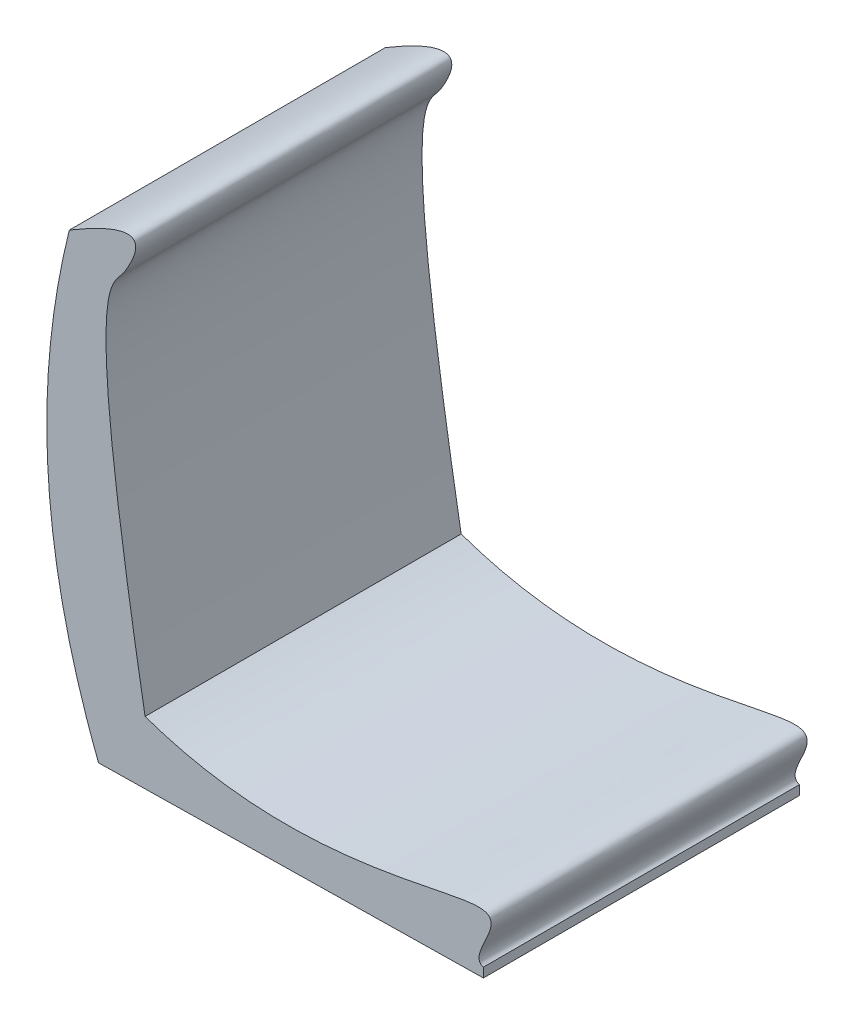
ISO-10303-21;
HEADER;
FILE_DESCRIPTION(('STEP AP214'),'2;1');
FILE_NAME('part.step','',(''),(''),'','','');
FILE_SCHEMA(('AUTOMOTIVE_DESIGN { 1 0 10303 214 1 1 1 1 }'));
ENDSEC;
DATA;
#1=APPLICATION_CONTEXT('core data for automotive mechanical design processes');
#2=APPLICATION_PROTOCOL_DEFINITION('international standard','automotive_design',2000,#1);
#3=PRODUCT_CONTEXT('',#1,'mechanical');
#4=PRODUCT('Part','Part','',(#3));
#5=PRODUCT_RELATED_PRODUCT_CATEGORY('part','',(#4));
#6=PRODUCT_DEFINITION_FORMATION('','',#4);
#7=PRODUCT_DEFINITION_CONTEXT('part definition',#1,'design');
#8=PRODUCT_DEFINITION('design','',#6,#7);
#9=PRODUCT_DEFINITION_SHAPE('','',#8);
#10=(LENGTH_UNIT() NAMED_UNIT(*) SI_UNIT(.MILLI.,.METRE.));
#11=(NAMED_UNIT(*) PLANE_ANGLE_UNIT() SI_UNIT($,.RADIAN.));
#12=(NAMED_UNIT(*) SI_UNIT($,.STERADIAN.) SOLID_ANGLE_UNIT());
#13=UNCERTAINTY_MEASURE_WITH_UNIT(LENGTH_MEASURE(1.E-05),#10,'distance_accuracy_value','');
#14=(GEOMETRIC_REPRESENTATION_CONTEXT(3) GLOBAL_UNCERTAINTY_ASSIGNED_CONTEXT((#13)) GLOBAL_UNIT_ASSIGNED_CONTEXT((#10,
#11,#12)) REPRESENTATION_CONTEXT('',''));
#15=CARTESIAN_POINT('',(0.,0.,0.));
#16=DIRECTION('',(0.,0.,1.));
#17=DIRECTION('',(1.,0.,0.));
#18=AXIS2_PLACEMENT_3D('',#15,#16,#17);
#19=CARTESIAN_POINT('',(363.769485966271,11.3362005591572,170.));
#20=DIRECTION('',(-0.999874354439681,-0.0158516665947739,0.));
#21=DIRECTION('',(0.0158516665947739,-0.999874354439681,0.));
#22=AXIS2_PLACEMENT_3D('',#19,#20,#21);
#23=PLANE('',#22);
#24=DIRECTION('',(-0.0158516665947739,0.999874354439681,0.));
#25=VECTOR('',#24,1.);
#26=CARTESIAN_POINT('',(363.769485966271,11.3362005591572,-170.));
#27=LINE('',#26,#25);
#28=CARTESIAN_POINT('',(363.928002632218,1.33745701476038,-170.));
#29=VERTEX_POINT('',#28);
#30=CARTESIAN_POINT('',(363.769485966271,11.3362005591572,-170.));
#31=VERTEX_POINT('',#30);
#32=EDGE_CURVE('E84',#29,#31,#27,.T.);
#33=ORIENTED_EDGE('',*,*,#32,.T.);
#34=DIRECTION('',(0.,0.,-1.));
#35=VECTOR('',#34,1.);
#36=CARTESIAN_POINT('',(363.769485966271,11.3362005591572,170.));
#37=LINE('',#36,#35);
#38=CARTESIAN_POINT('',(363.769485966271,11.3362005591572,170.));
#39=VERTEX_POINT('',#38);
#40=EDGE_CURVE('E11',#39,#31,#37,.T.);
#41=ORIENTED_EDGE('',*,*,#40,.F.);
#42=DIRECTION('',(-0.0158516665947739,0.999874354439681,0.));
#43=VECTOR('',#42,1.);
#44=CARTESIAN_POINT('',(363.769485966271,11.3362005591572,170.));
#45=LINE('',#44,#43);
#46=CARTESIAN_POINT('',(363.928002632218,1.33745701476038,170.));
#47=VERTEX_POINT('',#46);
#48=EDGE_CURVE('E78',#47,#39,#45,.T.);
#49=ORIENTED_EDGE('',*,*,#48,.F.);
#50=DIRECTION('',(0.,0.,-1.));
#51=VECTOR('',#50,1.);
#52=CARTESIAN_POINT('',(363.928002632218,1.33745701476038,170.));
#53=LINE('',#52,#51);
#54=EDGE_CURVE('E73',#47,#29,#53,.T.);
#55=ORIENTED_EDGE('',*,*,#54,.T.);
#56=EDGE_LOOP('',(#33,#41,#49,#55));
#57=FACE_BOUND('',#56,.T.);
#58=ADVANCED_FACE('F35',(#57),#23,.F.);
#59=CARTESIAN_POINT('',(-81.5168545077962,475.367364151518,170.));
#60=CARTESIAN_POINT('',(-82.7811158844958,470.304932433275,170.));
#61=CARTESIAN_POINT('',(-85.2215477803148,460.138150210215,170.));
#62=CARTESIAN_POINT('',(-89.6924466930047,439.866979620613,170.));
#63=CARTESIAN_POINT('',(-94.5384799487372,414.539481529264,170.));
#64=CARTESIAN_POINT('',(-99.1562538715719,384.199279399648,170.));
#65=CARTESIAN_POINT('',(-103.718426393131,343.806201553961,170.));
#66=CARTESIAN_POINT('',(-106.427442665198,293.43767581807,170.));
#67=CARTESIAN_POINT('',(-104.885012492461,233.20457503457,170.));
#68=CARTESIAN_POINT('',(-98.5488265595769,173.195950205866,170.));
#69=CARTESIAN_POINT('',(-89.2772276187725,123.388994875682,170.));
#70=CARTESIAN_POINT('',(-79.4671087369465,83.6676949331466,170.));
#71=CARTESIAN_POINT('',(-70.9172804866581,53.9459625175101,170.));
#72=CARTESIAN_POINT('',(-62.7892339814446,29.2168512033704,170.));
#73=CARTESIAN_POINT('',(-56.5943313014686,11.9661448879851,170.));
#74=CARTESIAN_POINT('',(-52.8796778820532,2.06917785632979,170.));
#75=CARTESIAN_POINT('',(-51.0209981225807,-2.78678938512905,170.));
#76=CARTESIAN_POINT('',(-50.0916478449538,-5.22626915134108,170.));
#77=B_SPLINE_CURVE_WITH_KNOTS('',3,(#59,#60,#61,#62,#63,#64,#65,#66,#67,#68,#69,#70,#71,#72,#73,
#74,#75,#76),.UNSPECIFIED.,.F.,.F.,(4,1,1,1,1,1,1,1,1,1,1,1,1,1,1,4),(0.,0.0316937263883437,
0.0633874527766874,0.126774905553375,0.190162358330062,0.253549811106749,0.380324716660124,
0.507099622213499,0.633874527766874,0.760649433320248,0.824036886096936,0.887424338873623,
0.95081179165031,0.982505518038654,0.998352381232826,1.014199244427),.UNSPECIFIED.);
#78=DIRECTION('',(0.,0.,-1.));
#79=VECTOR('',#78,1.);
#80=SURFACE_OF_LINEAR_EXTRUSION('',#77,#79);
#81=CARTESIAN_POINT('',(-81.5168545077962,475.367364151518,-170.));
#82=CARTESIAN_POINT('',(-82.7811158844958,470.304932433275,-170.));
#83=CARTESIAN_POINT('',(-85.2215477803148,460.138150210215,-170.));
#84=CARTESIAN_POINT('',(-89.6924466930047,439.866979620613,-170.));
#85=CARTESIAN_POINT('',(-94.5384799487372,414.539481529264,-170.));
#86=CARTESIAN_POINT('',(-99.1562538715719,384.199279399648,-170.));
#87=CARTESIAN_POINT('',(-103.718426393131,343.806201553961,-170.));
#88=CARTESIAN_POINT('',(-106.427442665198,293.43767581807,-170.));
#89=CARTESIAN_POINT('',(-104.885012492461,233.20457503457,-170.));
#90=CARTESIAN_POINT('',(-98.5488265595769,173.195950205866,-170.));
#91=CARTESIAN_POINT('',(-89.2772276187725,123.388994875682,-170.));
#92=CARTESIAN_POINT('',(-79.4671087369465,83.6676949331466,-170.));
#93=CARTESIAN_POINT('',(-70.9172804866581,53.9459625175101,-170.));
#94=CARTESIAN_POINT('',(-62.7892339814446,29.2168512033704,-170.));
#95=CARTESIAN_POINT('',(-56.5943313014686,11.9661448879851,-170.));
#96=CARTESIAN_POINT('',(-52.8796778820532,2.06917785632979,-170.));
#97=CARTESIAN_POINT('',(-51.0209981225807,-2.78678938512905,-170.));
#98=CARTESIAN_POINT('',(-50.0916478449538,-5.22626915134108,-170.));
#99=B_SPLINE_CURVE_WITH_KNOTS('',3,(#81,#82,#83,#84,#85,#86,#87,#88,#89,#90,#91,#92,#93,#94,#95,
#96,#97,#98),.UNSPECIFIED.,.F.,.F.,(4,1,1,1,1,1,1,1,1,1,1,1,1,1,1,4),(0.,0.0316937263883437,
0.0633874527766874,0.126774905553375,0.190162358330062,0.253549811106749,0.380324716660124,
0.507099622213499,0.633874527766874,0.760649433320248,0.824036886096936,0.887424338873623,
0.95081179165031,0.982505518038654,0.998352381232826,1.014199244427),.UNSPECIFIED.);
#100=CARTESIAN_POINT('',(-81.5168545077962,475.367364151518,-170.));
#101=VERTEX_POINT('',#100);
#102=CARTESIAN_POINT('',(-50.0916478449538,-5.22626915134108,-170.));
#103=VERTEX_POINT('',#102);
#104=EDGE_CURVE('E65',#101,#103,#99,.T.);
#105=ORIENTED_EDGE('',*,*,#104,.T.);
#106=DIRECTION('',(0.,0.,-1.));
#107=VECTOR('',#106,1.);
#108=CARTESIAN_POINT('',(-50.0916478449538,-5.22626915134108,170.));
#109=LINE('',#108,#107);
#110=CARTESIAN_POINT('',(-50.0916478449538,-5.22626915134108,170.));
#111=VERTEX_POINT('',#110);
#112=EDGE_CURVE('E75',#111,#103,#109,.T.);
#113=ORIENTED_EDGE('',*,*,#112,.F.);
#114=CARTESIAN_POINT('',(-81.5168545077962,475.367364151518,170.));
#115=VERTEX_POINT('',#114);
#116=EDGE_CURVE('E108',#115,#111,#77,.T.);
#117=ORIENTED_EDGE('',*,*,#116,.F.);
#118=DIRECTION('',(0.,0.,-1.));
#119=VECTOR('',#118,1.);
#120=CARTESIAN_POINT('',(-81.5168545077962,475.367364151518,170.));
#121=LINE('',#120,#119);
#122=EDGE_CURVE('E43',#115,#101,#121,.T.);
#123=ORIENTED_EDGE('',*,*,#122,.T.);
#124=EDGE_LOOP('',(#105,#113,#117,#123));
#125=FACE_BOUND('',#124,.T.);
#126=ADVANCED_FACE('F107',(#125),#80,.F.);
#127=CARTESIAN_POINT('',(-50.0916478449538,-5.22626915134108,170.));
#128=DIRECTION('',(-0.0158516665947753,0.999874354439681,0.));
#129=DIRECTION('',(-0.999874354439681,-0.0158516665947753,0.));
#130=AXIS2_PLACEMENT_3D('',#127,#128,#129);
#131=PLANE('',#130);
#132=DIRECTION('',(0.999874354439681,0.0158516665947753,0.));
#133=VECTOR('',#132,1.);
#134=CARTESIAN_POINT('',(-50.0916478449538,-5.22626915134108,-170.));
#135=LINE('',#134,#133);
#136=EDGE_CURVE('E70',#103,#29,#135,.T.);
#137=ORIENTED_EDGE('',*,*,#136,.T.);
#138=ORIENTED_EDGE('',*,*,#54,.F.);
#139=DIRECTION('',(0.999874354439681,0.0158516665947753,0.));
#140=VECTOR('',#139,1.);
#141=CARTESIAN_POINT('',(-50.0916478449538,-5.22626915134108,170.));
#142=LINE('',#141,#140);
#143=EDGE_CURVE('E51',#111,#47,#142,.T.);
#144=ORIENTED_EDGE('',*,*,#143,.F.);
#145=ORIENTED_EDGE('',*,*,#112,.T.);
#146=EDGE_LOOP('',(#137,#138,#144,#145));
#147=FACE_BOUND('',#146,.T.);
#148=ADVANCED_FACE('F72',(#147),#131,.F.);
#149=CARTESIAN_POINT('',(-104.086053199103,233.241987693703,170.));
#150=DIRECTION('',(0.,0.,-1.));
#151=DIRECTION('',(-1.,0.,0.));
#152=AXIS2_PLACEMENT_3D('',#149,#150,#151);
#153=PLANE('',#152);
#154=ORIENTED_EDGE('',*,*,#48,.T.);
#155=CARTESIAN_POINT('',(0.,63.0194065025194,170.));
#156=CARTESIAN_POINT('',(163.678009085017,5.3791940532927,170.));
#157=CARTESIAN_POINT('',(451.441883382702,117.775676676132,170.));
#158=CARTESIAN_POINT('',(344.876156313906,18.2392985329592,170.));
#159=CARTESIAN_POINT('',(363.769485966271,11.3362005591572,170.));
#160=B_SPLINE_CURVE_WITH_KNOTS('',3,(#155,#156,#157,#158,#159),.UNSPECIFIED.,.F.,.F.,(4,1,4),
(0.,0.478227054608275,0.872405198902487),.UNSPECIFIED.);
#161=CARTESIAN_POINT('',(0.,63.0194065025194,170.));
#162=VERTEX_POINT('',#161);
#163=EDGE_CURVE('E91',#39,#162,#160,.F.);
#164=ORIENTED_EDGE('',*,*,#163,.T.);
#165=CARTESIAN_POINT('',(-81.5168545077962,475.367364151518,170.));
#166=CARTESIAN_POINT('',(9.81422051195071,530.127267375744,170.));
#167=CARTESIAN_POINT('',(-16.9494455489173,472.96822329482,170.));
#168=CARTESIAN_POINT('',(-35.7109328149298,447.292156657434,170.));
#169=CARTESIAN_POINT('',(-64.2805139260612,428.6782645946,170.));
#170=CARTESIAN_POINT('',(0.,63.0194065025194,170.));
#171=B_SPLINE_CURVE_WITH_KNOTS('',3,(#165,#166,#167,#168,#169,#170),.UNSPECIFIED.,.F.,.F.,(4,1,
1,4),(0.,0.243320457792934,0.343320457792934,1.),.UNSPECIFIED.);
#172=EDGE_CURVE('E95',#162,#115,#171,.F.);
#173=ORIENTED_EDGE('',*,*,#172,.T.);
#174=ORIENTED_EDGE('',*,*,#116,.T.);
#175=ORIENTED_EDGE('',*,*,#143,.T.);
#176=EDGE_LOOP('',(#154,#164,#173,#174,#175));
#177=FACE_BOUND('',#176,.T.);
#178=ADVANCED_FACE('F139',(#177),#153,.F.);
#179=CARTESIAN_POINT('',(-104.086053199103,233.241987693703,-170.));
#180=DIRECTION('',(0.,0.,-1.));
#181=DIRECTION('',(-1.,0.,0.));
#182=AXIS2_PLACEMENT_3D('',#179,#180,#181);
#183=PLANE('',#182);
#184=ORIENTED_EDGE('',*,*,#104,.F.);
#185=CARTESIAN_POINT('',(-81.5168545077962,475.367364151518,-170.));
#186=CARTESIAN_POINT('',(9.81422051195071,530.127267375744,-170.));
#187=CARTESIAN_POINT('',(-16.9494455489173,472.96822329482,-170.));
#188=CARTESIAN_POINT('',(-35.7109328149298,447.292156657434,-170.));
#189=CARTESIAN_POINT('',(-64.2805139260612,428.6782645946,-170.));
#190=CARTESIAN_POINT('',(0.,63.0194065025194,-170.));
#191=B_SPLINE_CURVE_WITH_KNOTS('',3,(#185,#186,#187,#188,#189,#190),.UNSPECIFIED.,.F.,.F.,(4,1,
1,4),(0.,0.243320457792934,0.343320457792934,1.),.UNSPECIFIED.);
#192=CARTESIAN_POINT('',(0.,63.0194065025194,-170.));
#193=VERTEX_POINT('',#192);
#194=EDGE_CURVE('E112',#101,#193,#191,.T.);
#195=ORIENTED_EDGE('',*,*,#194,.T.);
#196=CARTESIAN_POINT('',(0.,63.0194065025194,-170.));
#197=CARTESIAN_POINT('',(163.678009085017,5.3791940532927,-170.));
#198=CARTESIAN_POINT('',(451.441883382702,117.775676676132,-170.));
#199=CARTESIAN_POINT('',(344.876156313906,18.2392985329592,-170.));
#200=CARTESIAN_POINT('',(363.769485966271,11.3362005591572,-170.));
#201=B_SPLINE_CURVE_WITH_KNOTS('',3,(#196,#197,#198,#199,#200),.UNSPECIFIED.,.F.,.F.,(4,1,4),
(0.,0.478227054608275,0.872405198902487),.UNSPECIFIED.);
#202=EDGE_CURVE('E90',#193,#31,#201,.T.);
#203=ORIENTED_EDGE('',*,*,#202,.T.);
#204=ORIENTED_EDGE('',*,*,#32,.F.);
#205=ORIENTED_EDGE('',*,*,#136,.F.);
#206=EDGE_LOOP('',(#184,#195,#203,#204,#205));
#207=FACE_BOUND('',#206,.T.);
#208=ADVANCED_FACE('F87',(#207),#183,.T.);
#209=CARTESIAN_POINT('',(0.,63.0194065025194,863.628994381063));
#210=CARTESIAN_POINT('',(163.678009085017,5.3791940532927,863.628994381063));
#211=CARTESIAN_POINT('',(451.441883382702,117.775676676132,863.628994381063));
#212=CARTESIAN_POINT('',(344.876156313906,18.2392985329592,863.628994381063));
#213=CARTESIAN_POINT('',(363.769485966271,11.3362005591572,863.628994381063));
#214=B_SPLINE_CURVE_WITH_KNOTS('',3,(#209,#210,#211,#212,#213),.UNSPECIFIED.,.F.,.F.,(4,1,4),
(0.,0.478227054608275,0.872405198902487),.UNSPECIFIED.);
#215=DIRECTION('',(0.,0.,-1.));
#216=VECTOR('',#215,1.);
#217=SURFACE_OF_LINEAR_EXTRUSION('',#214,#216);
#218=ORIENTED_EDGE('',*,*,#163,.F.);
#219=ORIENTED_EDGE('',*,*,#40,.T.);
#220=ORIENTED_EDGE('',*,*,#202,.F.);
#221=DIRECTION('',(0.,0.,-1.));
#222=VECTOR('',#221,1.);
#223=CARTESIAN_POINT('',(0.,63.0194065025194,863.628994381063));
#224=LINE('',#223,#222);
#225=EDGE_CURVE('E116',#162,#193,#224,.T.);
#226=ORIENTED_EDGE('',*,*,#225,.F.);
#227=EDGE_LOOP('',(#218,#219,#220,#226));
#228=FACE_BOUND('',#227,.T.);
#229=ADVANCED_FACE('F142',(#228),#217,.T.);
#230=CARTESIAN_POINT('',(-81.5168545077962,475.367364151518,863.628994381063));
#231=CARTESIAN_POINT('',(9.81422051195071,530.127267375744,863.628994381063));
#232=CARTESIAN_POINT('',(-16.9494455489173,472.96822329482,863.628994381063));
#233=CARTESIAN_POINT('',(-35.7109328149298,447.292156657434,863.628994381063));
#234=CARTESIAN_POINT('',(-64.2805139260612,428.6782645946,863.628994381063));
#235=CARTESIAN_POINT('',(0.,63.0194065025194,863.628994381063));
#236=B_SPLINE_CURVE_WITH_KNOTS('',3,(#230,#231,#232,#233,#234,#235),.UNSPECIFIED.,.F.,.F.,(4,1,
1,4),(0.,0.243320457792934,0.343320457792934,1.),.UNSPECIFIED.);
#237=DIRECTION('',(0.,0.,-1.));
#238=VECTOR('',#237,1.);
#239=SURFACE_OF_LINEAR_EXTRUSION('',#236,#238);
#240=ORIENTED_EDGE('',*,*,#172,.F.);
#241=ORIENTED_EDGE('',*,*,#225,.T.);
#242=ORIENTED_EDGE('',*,*,#194,.F.);
#243=ORIENTED_EDGE('',*,*,#122,.F.);
#244=EDGE_LOOP('',(#240,#241,#242,#243));
#245=FACE_BOUND('',#244,.T.);
#246=ADVANCED_FACE('F148',(#245),#239,.T.);
#247=CLOSED_SHELL('',(#58,#126,#148,#178,#208,#229,#246));
#248=MANIFOLD_SOLID_BREP('B2',#247);
#249=ADVANCED_BREP_SHAPE_REPRESENTATION('',(#18,#248),#14);
#250=SHAPE_DEFINITION_REPRESENTATION(#9,#249);
ENDSEC;
END-ISO-10303-21;
